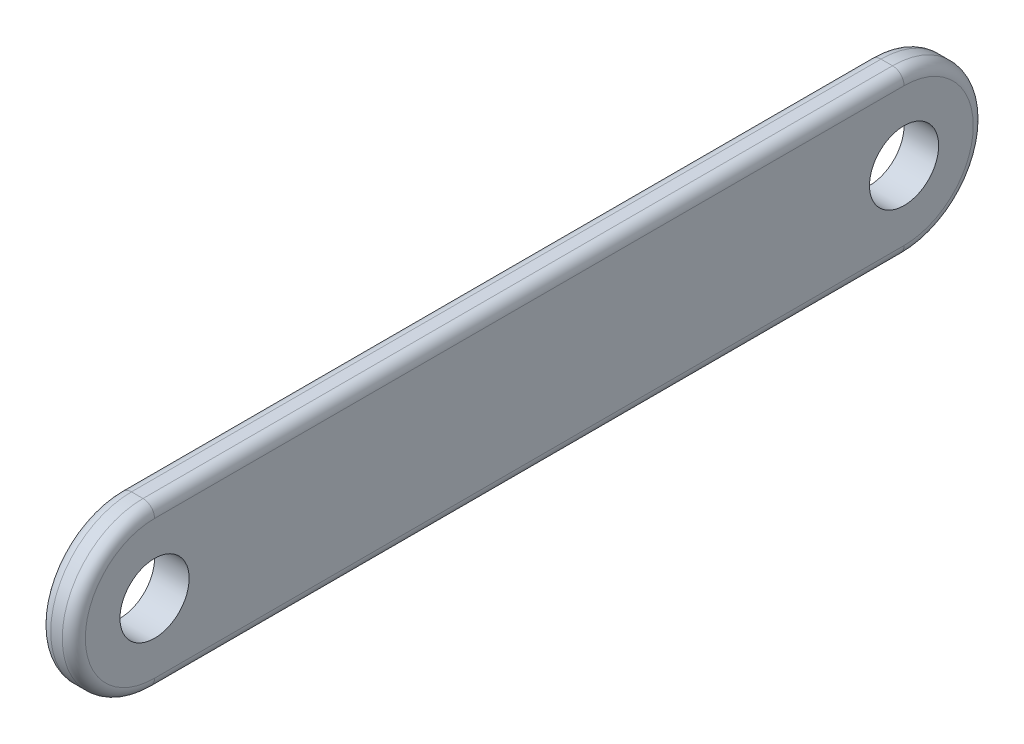
ISO-10303-21;
HEADER;
FILE_DESCRIPTION(('STEP AP214'),'2;1');
FILE_NAME('part.step','',(''),(''),'','','');
FILE_SCHEMA(('AUTOMOTIVE_DESIGN { 1 0 10303 214 1 1 1 1 }'));
ENDSEC;
DATA;
#1=APPLICATION_CONTEXT('core data for automotive mechanical design processes');
#2=APPLICATION_PROTOCOL_DEFINITION('international standard','automotive_design',2000,#1);
#3=PRODUCT_CONTEXT('',#1,'mechanical');
#4=PRODUCT('Part','Part','',(#3));
#5=PRODUCT_RELATED_PRODUCT_CATEGORY('part','',(#4));
#6=PRODUCT_DEFINITION_FORMATION('','',#4);
#7=PRODUCT_DEFINITION_CONTEXT('part definition',#1,'design');
#8=PRODUCT_DEFINITION('design','',#6,#7);
#9=PRODUCT_DEFINITION_SHAPE('','',#8);
#10=(LENGTH_UNIT() NAMED_UNIT(*) SI_UNIT(.MILLI.,.METRE.));
#11=(NAMED_UNIT(*) PLANE_ANGLE_UNIT() SI_UNIT($,.RADIAN.));
#12=(NAMED_UNIT(*) SI_UNIT($,.STERADIAN.) SOLID_ANGLE_UNIT());
#13=UNCERTAINTY_MEASURE_WITH_UNIT(LENGTH_MEASURE(1.E-05),#10,'distance_accuracy_value','');
#14=(GEOMETRIC_REPRESENTATION_CONTEXT(3) GLOBAL_UNCERTAINTY_ASSIGNED_CONTEXT((#13)) GLOBAL_UNIT_ASSIGNED_CONTEXT((#10,
#11,#12)) REPRESENTATION_CONTEXT('',''));
#15=CARTESIAN_POINT('',(0.,0.,0.));
#16=DIRECTION('',(0.,0.,1.));
#17=DIRECTION('',(1.,0.,0.));
#18=AXIS2_PLACEMENT_3D('',#15,#16,#17);
#19=CARTESIAN_POINT('',(3.,0.,32.5));
#20=DIRECTION('',(1.,0.,0.));
#21=DIRECTION('',(0.,0.,-1.));
#22=AXIS2_PLACEMENT_3D('',#19,#20,#21);
#23=PLANE('',#22);
#24=DIRECTION('',(0.,0.,-1.));
#25=VECTOR('',#24,1.);
#26=CARTESIAN_POINT('',(3.,-6.00000000000002,-32.5));
#27=LINE('',#26,#25);
#28=CARTESIAN_POINT('',(3.,-6.00000000000001,32.5));
#29=VERTEX_POINT('',#28);
#30=CARTESIAN_POINT('',(3.,-6.00000000000002,-32.5));
#31=VERTEX_POINT('',#30);
#32=EDGE_CURVE('E53',#29,#31,#27,.T.);
#33=ORIENTED_EDGE('',*,*,#32,.T.);
#34=CARTESIAN_POINT('',(3.,0.,-32.5));
#35=DIRECTION('',(1.,0.,0.));
#36=DIRECTION('',(0.,0.,-1.));
#37=AXIS2_PLACEMENT_3D('',#34,#35,#36);
#38=CIRCLE('',#37,6.00000000000002);
#39=CARTESIAN_POINT('',(3.,6.00000000000002,-32.5));
#40=VERTEX_POINT('',#39);
#41=EDGE_CURVE('E112',#31,#40,#38,.T.);
#42=ORIENTED_EDGE('',*,*,#41,.T.);
#43=DIRECTION('',(0.,0.,1.));
#44=VECTOR('',#43,1.);
#45=CARTESIAN_POINT('',(3.,6.00000000000002,32.5));
#46=LINE('',#45,#44);
#47=CARTESIAN_POINT('',(3.,6.00000000000002,32.5));
#48=VERTEX_POINT('',#47);
#49=EDGE_CURVE('E136',#40,#48,#46,.T.);
#50=ORIENTED_EDGE('',*,*,#49,.T.);
#51=CARTESIAN_POINT('',(3.,0.,32.5));
#52=DIRECTION('',(1.,0.,0.));
#53=DIRECTION('',(0.,0.,-1.));
#54=AXIS2_PLACEMENT_3D('',#51,#52,#53);
#55=CIRCLE('',#54,6.00000000000002);
#56=EDGE_CURVE('E58',#48,#29,#55,.T.);
#57=ORIENTED_EDGE('',*,*,#56,.T.);
#58=EDGE_LOOP('',(#33,#42,#50,#57));
#59=FACE_BOUND('',#58,.T.);
#60=CARTESIAN_POINT('',(3.,0.,32.5));
#61=DIRECTION('',(1.,0.,0.));
#62=DIRECTION('',(0.,0.,-1.));
#63=AXIS2_PLACEMENT_3D('',#60,#61,#62);
#64=CIRCLE('',#63,2.99999999999999);
#65=CARTESIAN_POINT('',(3.,0.,29.5));
#66=VERTEX_POINT('',#65);
#67=EDGE_CURVE('E173',#66,#66,#64,.T.);
#68=ORIENTED_EDGE('',*,*,#67,.F.);
#69=EDGE_LOOP('',(#68));
#70=FACE_BOUND('',#69,.T.);
#71=CARTESIAN_POINT('',(3.,0.,-32.5));
#72=DIRECTION('',(1.,0.,0.));
#73=DIRECTION('',(0.,0.,-1.));
#74=AXIS2_PLACEMENT_3D('',#71,#72,#73);
#75=CIRCLE('',#74,2.99999999999999);
#76=CARTESIAN_POINT('',(3.,0.,-35.5));
#77=VERTEX_POINT('',#76);
#78=EDGE_CURVE('E165',#77,#77,#75,.T.);
#79=ORIENTED_EDGE('',*,*,#78,.F.);
#80=EDGE_LOOP('',(#79));
#81=FACE_BOUND('',#80,.T.);
#82=ADVANCED_FACE('F36',(#59,#70,#81),#23,.T.);
#83=CARTESIAN_POINT('',(0.,0.,32.5));
#84=DIRECTION('',(1.,0.,0.));
#85=DIRECTION('',(0.,0.,-1.));
#86=AXIS2_PLACEMENT_3D('',#83,#84,#85);
#87=PLANE('',#86);
#88=DIRECTION('',(0.,0.,1.));
#89=VECTOR('',#88,1.);
#90=CARTESIAN_POINT('',(0.,6.00000000000002,32.5));
#91=LINE('',#90,#89);
#92=CARTESIAN_POINT('',(0.,6.00000000000002,32.5));
#93=VERTEX_POINT('',#92);
#94=CARTESIAN_POINT('',(0.,6.00000000000002,-32.5));
#95=VERTEX_POINT('',#94);
#96=EDGE_CURVE('E183',#93,#95,#91,.F.);
#97=ORIENTED_EDGE('',*,*,#96,.T.);
#98=CARTESIAN_POINT('',(0.,0.,-32.5));
#99=DIRECTION('',(1.,0.,0.));
#100=DIRECTION('',(0.,0.,-1.));
#101=AXIS2_PLACEMENT_3D('',#98,#99,#100);
#102=CIRCLE('',#101,6.00000000000002);
#103=CARTESIAN_POINT('',(0.,-6.00000000000002,-32.5));
#104=VERTEX_POINT('',#103);
#105=EDGE_CURVE('E189',#95,#104,#102,.F.);
#106=ORIENTED_EDGE('',*,*,#105,.T.);
#107=DIRECTION('',(0.,0.,-1.));
#108=VECTOR('',#107,1.);
#109=CARTESIAN_POINT('',(0.,-6.00000000000002,32.5));
#110=LINE('',#109,#108);
#111=CARTESIAN_POINT('',(0.,-6.00000000000001,32.5));
#112=VERTEX_POINT('',#111);
#113=EDGE_CURVE('E187',#104,#112,#110,.F.);
#114=ORIENTED_EDGE('',*,*,#113,.T.);
#115=CARTESIAN_POINT('',(0.,0.,32.5));
#116=DIRECTION('',(1.,0.,0.));
#117=DIRECTION('',(0.,0.,-1.));
#118=AXIS2_PLACEMENT_3D('',#115,#116,#117);
#119=CIRCLE('',#118,6.00000000000002);
#120=EDGE_CURVE('E185',#112,#93,#119,.F.);
#121=ORIENTED_EDGE('',*,*,#120,.T.);
#122=EDGE_LOOP('',(#97,#106,#114,#121));
#123=FACE_BOUND('',#122,.T.);
#124=CARTESIAN_POINT('',(0.,0.,32.5));
#125=DIRECTION('',(1.,0.,0.));
#126=DIRECTION('',(0.,0.,-1.));
#127=AXIS2_PLACEMENT_3D('',#124,#125,#126);
#128=CIRCLE('',#127,2.99999999999999);
#129=CARTESIAN_POINT('',(0.,0.,29.5));
#130=VERTEX_POINT('',#129);
#131=EDGE_CURVE('E170',#130,#130,#128,.T.);
#132=ORIENTED_EDGE('',*,*,#131,.T.);
#133=EDGE_LOOP('',(#132));
#134=FACE_BOUND('',#133,.T.);
#135=CARTESIAN_POINT('',(0.,0.,-32.5));
#136=DIRECTION('',(1.,0.,0.));
#137=DIRECTION('',(0.,0.,-1.));
#138=AXIS2_PLACEMENT_3D('',#135,#136,#137);
#139=CIRCLE('',#138,2.99999999999999);
#140=CARTESIAN_POINT('',(0.,0.,-35.5));
#141=VERTEX_POINT('',#140);
#142=EDGE_CURVE('E159',#141,#141,#139,.T.);
#143=ORIENTED_EDGE('',*,*,#142,.T.);
#144=EDGE_LOOP('',(#143));
#145=FACE_BOUND('',#144,.T.);
#146=ADVANCED_FACE('F229',(#123,#134,#145),#87,.F.);
#147=CARTESIAN_POINT('',(3.,0.,32.5));
#148=DIRECTION('',(-1.,0.,0.));
#149=DIRECTION('',(0.,0.,1.));
#150=AXIS2_PLACEMENT_3D('',#147,#148,#149);
#151=CYLINDRICAL_SURFACE('',#150,7.00000000000002);
#152=DIRECTION('',(-1.,0.,0.));
#153=VECTOR('',#152,1.);
#154=CARTESIAN_POINT('',(3.,7.00000000000002,32.5));
#155=LINE('',#154,#153);
#156=CARTESIAN_POINT('',(2.,7.00000000000002,32.5));
#157=VERTEX_POINT('',#156);
#158=CARTESIAN_POINT('',(1.,7.00000000000002,32.5));
#159=VERTEX_POINT('',#158);
#160=EDGE_CURVE('E107',#157,#159,#155,.T.);
#161=ORIENTED_EDGE('',*,*,#160,.T.);
#162=CARTESIAN_POINT('',(1.,0.,32.5));
#163=DIRECTION('',(1.,0.,0.));
#164=DIRECTION('',(0.,0.,-1.));
#165=AXIS2_PLACEMENT_3D('',#162,#163,#164);
#166=CIRCLE('',#165,7.00000000000002);
#167=CARTESIAN_POINT('',(1.,-7.00000000000002,32.5));
#168=VERTEX_POINT('',#167);
#169=EDGE_CURVE('E198',#159,#168,#166,.T.);
#170=ORIENTED_EDGE('',*,*,#169,.T.);
#171=DIRECTION('',(-1.,0.,0.));
#172=VECTOR('',#171,1.);
#173=CARTESIAN_POINT('',(3.,-7.00000000000002,32.5));
#174=LINE('',#173,#172);
#175=CARTESIAN_POINT('',(2.,-7.00000000000002,32.5));
#176=VERTEX_POINT('',#175);
#177=EDGE_CURVE('E133',#176,#168,#174,.T.);
#178=ORIENTED_EDGE('',*,*,#177,.F.);
#179=CARTESIAN_POINT('',(2.,0.,32.5));
#180=DIRECTION('',(1.,0.,0.));
#181=DIRECTION('',(0.,0.,-1.));
#182=AXIS2_PLACEMENT_3D('',#179,#180,#181);
#183=CIRCLE('',#182,7.00000000000002);
#184=EDGE_CURVE('E196',#176,#157,#183,.F.);
#185=ORIENTED_EDGE('',*,*,#184,.T.);
#186=EDGE_LOOP('',(#161,#170,#178,#185));
#187=FACE_BOUND('',#186,.T.);
#188=ADVANCED_FACE('F211',(#187),#151,.T.);
#189=CARTESIAN_POINT('',(3.,-7.00000000000002,32.5));
#190=DIRECTION('',(0.,1.,0.));
#191=DIRECTION('',(0.,0.,1.));
#192=AXIS2_PLACEMENT_3D('',#189,#190,#191);
#193=PLANE('',#192);
#194=ORIENTED_EDGE('',*,*,#177,.T.);
#195=DIRECTION('',(0.,0.,-1.));
#196=VECTOR('',#195,1.);
#197=CARTESIAN_POINT('',(1.,-7.00000000000002,32.5));
#198=LINE('',#197,#196);
#199=CARTESIAN_POINT('',(1.,-7.00000000000001,-32.5));
#200=VERTEX_POINT('',#199);
#201=EDGE_CURVE('E194',#168,#200,#198,.T.);
#202=ORIENTED_EDGE('',*,*,#201,.T.);
#203=DIRECTION('',(-1.,0.,0.));
#204=VECTOR('',#203,1.);
#205=CARTESIAN_POINT('',(3.,-7.00000000000001,-32.5));
#206=LINE('',#205,#204);
#207=CARTESIAN_POINT('',(2.,-7.00000000000001,-32.5));
#208=VERTEX_POINT('',#207);
#209=EDGE_CURVE('E124',#208,#200,#206,.T.);
#210=ORIENTED_EDGE('',*,*,#209,.F.);
#211=DIRECTION('',(0.,0.,-1.));
#212=VECTOR('',#211,1.);
#213=CARTESIAN_POINT('',(2.,-7.00000000000002,32.5));
#214=LINE('',#213,#212);
#215=EDGE_CURVE('E192',#208,#176,#214,.F.);
#216=ORIENTED_EDGE('',*,*,#215,.T.);
#217=EDGE_LOOP('',(#194,#202,#210,#216));
#218=FACE_BOUND('',#217,.T.);
#219=ADVANCED_FACE('F209',(#218),#193,.F.);
#220=CARTESIAN_POINT('',(3.,0.,-32.5));
#221=DIRECTION('',(-1.,0.,0.));
#222=DIRECTION('',(0.,0.,1.));
#223=AXIS2_PLACEMENT_3D('',#220,#221,#222);
#224=CYLINDRICAL_SURFACE('',#223,7.00000000000002);
#225=ORIENTED_EDGE('',*,*,#209,.T.);
#226=CARTESIAN_POINT('',(1.,0.,-32.5));
#227=DIRECTION('',(1.,0.,0.));
#228=DIRECTION('',(0.,0.,-1.));
#229=AXIS2_PLACEMENT_3D('',#226,#227,#228);
#230=CIRCLE('',#229,7.00000000000002);
#231=CARTESIAN_POINT('',(1.,7.00000000000002,-32.5));
#232=VERTEX_POINT('',#231);
#233=EDGE_CURVE('E123',#200,#232,#230,.T.);
#234=ORIENTED_EDGE('',*,*,#233,.T.);
#235=DIRECTION('',(-1.,0.,0.));
#236=VECTOR('',#235,1.);
#237=CARTESIAN_POINT('',(3.,7.00000000000002,-32.5));
#238=LINE('',#237,#236);
#239=CARTESIAN_POINT('',(2.,7.00000000000002,-32.5));
#240=VERTEX_POINT('',#239);
#241=EDGE_CURVE('E105',#240,#232,#238,.T.);
#242=ORIENTED_EDGE('',*,*,#241,.F.);
#243=CARTESIAN_POINT('',(2.,0.,-32.5));
#244=DIRECTION('',(1.,0.,0.));
#245=DIRECTION('',(0.,0.,-1.));
#246=AXIS2_PLACEMENT_3D('',#243,#244,#245);
#247=CIRCLE('',#246,7.00000000000002);
#248=EDGE_CURVE('E120',#240,#208,#247,.F.);
#249=ORIENTED_EDGE('',*,*,#248,.T.);
#250=EDGE_LOOP('',(#225,#234,#242,#249));
#251=FACE_BOUND('',#250,.T.);
#252=ADVANCED_FACE('F119',(#251),#224,.T.);
#253=CARTESIAN_POINT('',(3.,7.00000000000002,32.5));
#254=DIRECTION('',(0.,-1.,0.));
#255=DIRECTION('',(0.,0.,-1.));
#256=AXIS2_PLACEMENT_3D('',#253,#254,#255);
#257=PLANE('',#256);
#258=ORIENTED_EDGE('',*,*,#241,.T.);
#259=DIRECTION('',(0.,0.,1.));
#260=VECTOR('',#259,1.);
#261=CARTESIAN_POINT('',(1.,7.00000000000002,32.5));
#262=LINE('',#261,#260);
#263=EDGE_CURVE('E11',#232,#159,#262,.T.);
#264=ORIENTED_EDGE('',*,*,#263,.T.);
#265=ORIENTED_EDGE('',*,*,#160,.F.);
#266=DIRECTION('',(0.,0.,1.));
#267=VECTOR('',#266,1.);
#268=CARTESIAN_POINT('',(2.,7.00000000000002,-32.5));
#269=LINE('',#268,#267);
#270=EDGE_CURVE('E45',#157,#240,#269,.F.);
#271=ORIENTED_EDGE('',*,*,#270,.T.);
#272=EDGE_LOOP('',(#258,#264,#265,#271));
#273=FACE_BOUND('',#272,.T.);
#274=ADVANCED_FACE('F104',(#273),#257,.F.);
#275=CARTESIAN_POINT('',(3.,0.,32.5));
#276=DIRECTION('',(-1.,0.,0.));
#277=DIRECTION('',(0.,0.,1.));
#278=AXIS2_PLACEMENT_3D('',#275,#276,#277);
#279=CYLINDRICAL_SURFACE('',#278,2.99999999999999);
#280=ORIENTED_EDGE('',*,*,#67,.T.);
#281=EDGE_LOOP('',(#280));
#282=FACE_BOUND('',#281,.T.);
#283=ORIENTED_EDGE('',*,*,#131,.F.);
#284=EDGE_LOOP('',(#283));
#285=FACE_BOUND('',#284,.T.);
#286=ADVANCED_FACE('F237',(#282,#285),#279,.F.);
#287=CARTESIAN_POINT('',(3.,0.,-32.5));
#288=DIRECTION('',(-1.,0.,0.));
#289=DIRECTION('',(0.,0.,1.));
#290=AXIS2_PLACEMENT_3D('',#287,#288,#289);
#291=CYLINDRICAL_SURFACE('',#290,2.99999999999999);
#292=ORIENTED_EDGE('',*,*,#78,.T.);
#293=EDGE_LOOP('',(#292));
#294=FACE_BOUND('',#293,.T.);
#295=ORIENTED_EDGE('',*,*,#142,.F.);
#296=EDGE_LOOP('',(#295));
#297=FACE_BOUND('',#296,.T.);
#298=ADVANCED_FACE('F269',(#294,#297),#291,.F.);
#299=CARTESIAN_POINT('',(1.,0.,32.5));
#300=DIRECTION('',(1.,0.,0.));
#301=DIRECTION('',(0.,0.,-1.));
#302=AXIS2_PLACEMENT_3D('',#299,#300,#301);
#303=TOROIDAL_SURFACE('',#302,6.00000000000002,1.);
#304=CARTESIAN_POINT('',(1.,6.00000000000002,32.5));
#305=DIRECTION('',(0.,0.,-1.));
#306=DIRECTION('',(-1.,0.,0.));
#307=AXIS2_PLACEMENT_3D('',#304,#305,#306);
#308=CIRCLE('',#307,1.);
#309=EDGE_CURVE('E152',#93,#159,#308,.T.);
#310=ORIENTED_EDGE('',*,*,#309,.F.);
#311=ORIENTED_EDGE('',*,*,#120,.F.);
#312=CARTESIAN_POINT('',(1.,-6.00000000000001,32.5));
#313=DIRECTION('',(0.,0.,-1.));
#314=DIRECTION('',(-1.,0.,0.));
#315=AXIS2_PLACEMENT_3D('',#312,#313,#314);
#316=CIRCLE('',#315,1.);
#317=EDGE_CURVE('E141',#168,#112,#316,.T.);
#318=ORIENTED_EDGE('',*,*,#317,.F.);
#319=ORIENTED_EDGE('',*,*,#169,.F.);
#320=EDGE_LOOP('',(#310,#311,#318,#319));
#321=FACE_BOUND('',#320,.T.);
#322=ADVANCED_FACE('F214',(#321),#303,.T.);
#323=CARTESIAN_POINT('',(1.,-6.00000000000002,32.5));
#324=DIRECTION('',(0.,0.,-1.));
#325=DIRECTION('',(-1.,0.,0.));
#326=AXIS2_PLACEMENT_3D('',#323,#324,#325);
#327=CYLINDRICAL_SURFACE('',#326,1.);
#328=ORIENTED_EDGE('',*,*,#317,.T.);
#329=ORIENTED_EDGE('',*,*,#113,.F.);
#330=CARTESIAN_POINT('',(1.,-6.00000000000002,-32.5));
#331=DIRECTION('',(0.,0.,-1.));
#332=DIRECTION('',(-1.,0.,0.));
#333=AXIS2_PLACEMENT_3D('',#330,#331,#332);
#334=CIRCLE('',#333,1.);
#335=EDGE_CURVE('E146',#200,#104,#334,.T.);
#336=ORIENTED_EDGE('',*,*,#335,.F.);
#337=ORIENTED_EDGE('',*,*,#201,.F.);
#338=EDGE_LOOP('',(#328,#329,#336,#337));
#339=FACE_BOUND('',#338,.T.);
#340=ADVANCED_FACE('F217',(#339),#327,.T.);
#341=CARTESIAN_POINT('',(1.,6.00000000000002,32.5));
#342=DIRECTION('',(0.,0.,1.));
#343=DIRECTION('',(1.,0.,0.));
#344=AXIS2_PLACEMENT_3D('',#341,#342,#343);
#345=CYLINDRICAL_SURFACE('',#344,1.);
#346=ORIENTED_EDGE('',*,*,#309,.T.);
#347=ORIENTED_EDGE('',*,*,#263,.F.);
#348=CARTESIAN_POINT('',(1.,6.00000000000002,-32.5));
#349=DIRECTION('',(0.,0.,-1.));
#350=DIRECTION('',(-1.,0.,0.));
#351=AXIS2_PLACEMENT_3D('',#348,#349,#350);
#352=CIRCLE('',#351,1.);
#353=EDGE_CURVE('E144',#95,#232,#352,.T.);
#354=ORIENTED_EDGE('',*,*,#353,.F.);
#355=ORIENTED_EDGE('',*,*,#96,.F.);
#356=EDGE_LOOP('',(#346,#347,#354,#355));
#357=FACE_BOUND('',#356,.T.);
#358=ADVANCED_FACE('F220',(#357),#345,.T.);
#359=CARTESIAN_POINT('',(1.,0.,-32.5));
#360=DIRECTION('',(1.,0.,0.));
#361=DIRECTION('',(0.,0.,-1.));
#362=AXIS2_PLACEMENT_3D('',#359,#360,#361);
#363=TOROIDAL_SURFACE('',#362,6.00000000000002,1.);
#364=ORIENTED_EDGE('',*,*,#335,.T.);
#365=ORIENTED_EDGE('',*,*,#105,.F.);
#366=ORIENTED_EDGE('',*,*,#353,.T.);
#367=ORIENTED_EDGE('',*,*,#233,.F.);
#368=EDGE_LOOP('',(#364,#365,#366,#367));
#369=FACE_BOUND('',#368,.T.);
#370=ADVANCED_FACE('F218',(#369),#363,.T.);
#371=CARTESIAN_POINT('',(2.,0.,32.5));
#372=DIRECTION('',(1.,0.,0.));
#373=DIRECTION('',(0.,0.,-1.));
#374=AXIS2_PLACEMENT_3D('',#371,#372,#373);
#375=TOROIDAL_SURFACE('',#374,6.00000000000002,1.);
#376=CARTESIAN_POINT('',(2.,6.00000000000002,32.5));
#377=DIRECTION('',(0.,0.,-1.));
#378=DIRECTION('',(-1.,0.,0.));
#379=AXIS2_PLACEMENT_3D('',#376,#377,#378);
#380=CIRCLE('',#379,1.);
#381=EDGE_CURVE('E138',#157,#48,#380,.T.);
#382=ORIENTED_EDGE('',*,*,#381,.F.);
#383=ORIENTED_EDGE('',*,*,#184,.F.);
#384=CARTESIAN_POINT('',(2.,-6.00000000000001,32.5));
#385=DIRECTION('',(0.,0.,-1.));
#386=DIRECTION('',(-1.,0.,0.));
#387=AXIS2_PLACEMENT_3D('',#384,#385,#386);
#388=CIRCLE('',#387,1.);
#389=EDGE_CURVE('E40',#29,#176,#388,.T.);
#390=ORIENTED_EDGE('',*,*,#389,.F.);
#391=ORIENTED_EDGE('',*,*,#56,.F.);
#392=EDGE_LOOP('',(#382,#383,#390,#391));
#393=FACE_BOUND('',#392,.T.);
#394=ADVANCED_FACE('F38',(#393),#375,.T.);
#395=CARTESIAN_POINT('',(2.,-6.00000000000002,32.5));
#396=DIRECTION('',(0.,0.,1.));
#397=DIRECTION('',(1.,0.,0.));
#398=AXIS2_PLACEMENT_3D('',#395,#396,#397);
#399=CYLINDRICAL_SURFACE('',#398,1.);
#400=ORIENTED_EDGE('',*,*,#389,.T.);
#401=ORIENTED_EDGE('',*,*,#215,.F.);
#402=CARTESIAN_POINT('',(2.,-6.00000000000002,-32.5));
#403=DIRECTION('',(0.,0.,-1.));
#404=DIRECTION('',(-1.,0.,0.));
#405=AXIS2_PLACEMENT_3D('',#402,#403,#404);
#406=CIRCLE('',#405,1.);
#407=EDGE_CURVE('E131',#31,#208,#406,.T.);
#408=ORIENTED_EDGE('',*,*,#407,.F.);
#409=ORIENTED_EDGE('',*,*,#32,.F.);
#410=EDGE_LOOP('',(#400,#401,#408,#409));
#411=FACE_BOUND('',#410,.T.);
#412=ADVANCED_FACE('F206',(#411),#399,.T.);
#413=CARTESIAN_POINT('',(2.,6.00000000000002,32.5));
#414=DIRECTION('',(0.,0.,-1.));
#415=DIRECTION('',(-1.,0.,0.));
#416=AXIS2_PLACEMENT_3D('',#413,#414,#415);
#417=CYLINDRICAL_SURFACE('',#416,1.);
#418=ORIENTED_EDGE('',*,*,#381,.T.);
#419=ORIENTED_EDGE('',*,*,#49,.F.);
#420=CARTESIAN_POINT('',(2.,6.00000000000002,-32.5));
#421=DIRECTION('',(0.,0.,-1.));
#422=DIRECTION('',(-1.,0.,0.));
#423=AXIS2_PLACEMENT_3D('',#420,#421,#422);
#424=CIRCLE('',#423,1.);
#425=EDGE_CURVE('E129',#240,#40,#424,.T.);
#426=ORIENTED_EDGE('',*,*,#425,.F.);
#427=ORIENTED_EDGE('',*,*,#270,.F.);
#428=EDGE_LOOP('',(#418,#419,#426,#427));
#429=FACE_BOUND('',#428,.T.);
#430=ADVANCED_FACE('F135',(#429),#417,.T.);
#431=CARTESIAN_POINT('',(2.,0.,-32.5));
#432=DIRECTION('',(1.,0.,0.));
#433=DIRECTION('',(0.,0.,-1.));
#434=AXIS2_PLACEMENT_3D('',#431,#432,#433);
#435=TOROIDAL_SURFACE('',#434,6.00000000000002,1.);
#436=ORIENTED_EDGE('',*,*,#407,.T.);
#437=ORIENTED_EDGE('',*,*,#248,.F.);
#438=ORIENTED_EDGE('',*,*,#425,.T.);
#439=ORIENTED_EDGE('',*,*,#41,.F.);
#440=EDGE_LOOP('',(#436,#437,#438,#439));
#441=FACE_BOUND('',#440,.T.);
#442=ADVANCED_FACE('F127',(#441),#435,.T.);
#443=CLOSED_SHELL('',(#82,#146,#188,#219,#252,#274,#286,#298,#322,#340,#358,#370,#394,#412,#430,#442));
#444=MANIFOLD_SOLID_BREP('B2',#443);
#445=ADVANCED_BREP_SHAPE_REPRESENTATION('',(#18,#444),#14);
#446=SHAPE_DEFINITION_REPRESENTATION(#9,#445);
ENDSEC;
END-ISO-10303-21;
